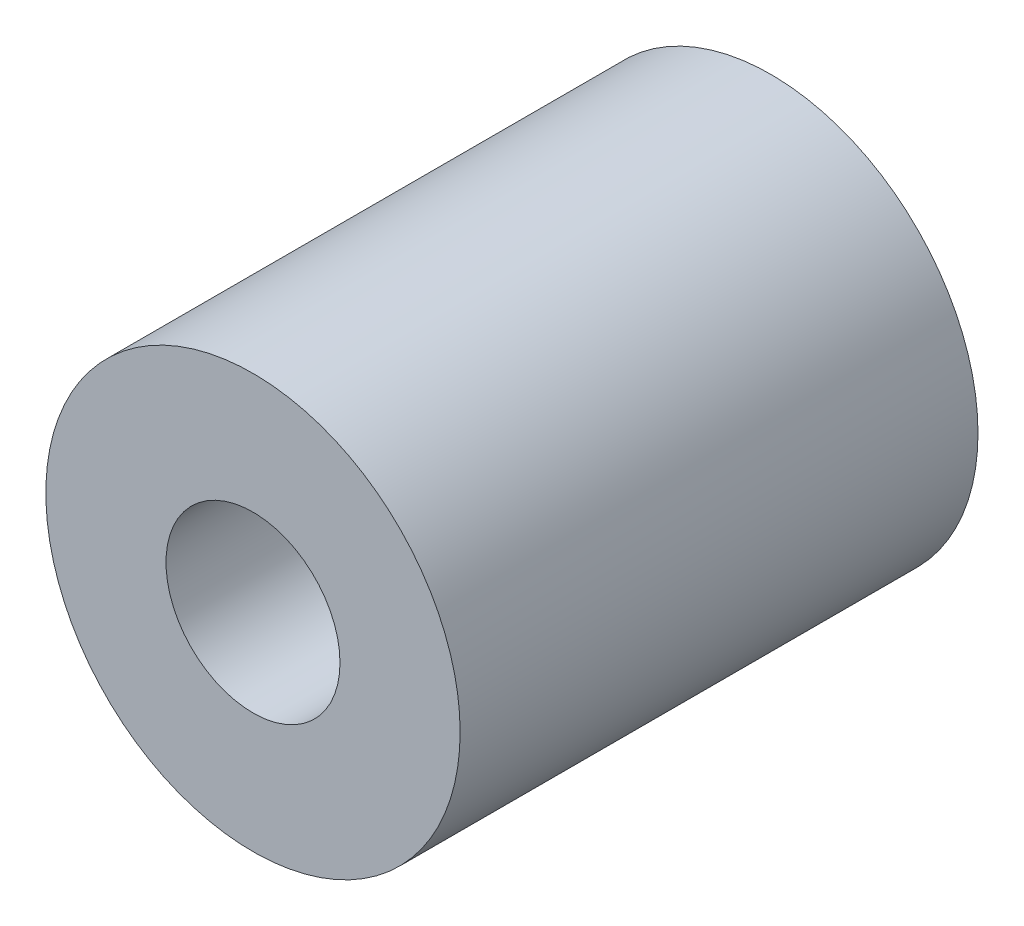
ISO-10303-21;
HEADER;
FILE_DESCRIPTION(('STEP AP214'),'2;1');
FILE_NAME('part.step','',(''),(''),'','','');
FILE_SCHEMA(('AUTOMOTIVE_DESIGN { 1 0 10303 214 1 1 1 1 }'));
ENDSEC;
DATA;
#1=APPLICATION_CONTEXT('core data for automotive mechanical design processes');
#2=APPLICATION_PROTOCOL_DEFINITION('international standard','automotive_design',2000,#1);
#3=PRODUCT_CONTEXT('',#1,'mechanical');
#4=PRODUCT('Part','Part','',(#3));
#5=PRODUCT_RELATED_PRODUCT_CATEGORY('part','',(#4));
#6=PRODUCT_DEFINITION_FORMATION('','',#4);
#7=PRODUCT_DEFINITION_CONTEXT('part definition',#1,'design');
#8=PRODUCT_DEFINITION('design','',#6,#7);
#9=PRODUCT_DEFINITION_SHAPE('','',#8);
#10=(LENGTH_UNIT() NAMED_UNIT(*) SI_UNIT(.MILLI.,.METRE.));
#11=(NAMED_UNIT(*) PLANE_ANGLE_UNIT() SI_UNIT($,.RADIAN.));
#12=(NAMED_UNIT(*) SI_UNIT($,.STERADIAN.) SOLID_ANGLE_UNIT());
#13=UNCERTAINTY_MEASURE_WITH_UNIT(LENGTH_MEASURE(1.E-05),#10,'distance_accuracy_value','');
#14=(GEOMETRIC_REPRESENTATION_CONTEXT(3) GLOBAL_UNCERTAINTY_ASSIGNED_CONTEXT((#13)) GLOBAL_UNIT_ASSIGNED_CONTEXT((#10,
#11,#12)) REPRESENTATION_CONTEXT('',''));
#15=CARTESIAN_POINT('',(0.,0.,0.));
#16=DIRECTION('',(0.,0.,1.));
#17=DIRECTION('',(1.,0.,0.));
#18=AXIS2_PLACEMENT_3D('',#15,#16,#17);
#19=CARTESIAN_POINT('',(0.,0.,25.));
#20=DIRECTION('',(0.,0.,-1.));
#21=DIRECTION('',(-1.,0.,0.));
#22=AXIS2_PLACEMENT_3D('',#19,#20,#21);
#23=CYLINDRICAL_SURFACE('',#22,10.);
#24=CARTESIAN_POINT('',(0.,0.,25.));
#25=DIRECTION('',(0.,0.,1.));
#26=DIRECTION('',(1.,0.,0.));
#27=AXIS2_PLACEMENT_3D('',#24,#25,#26);
#28=CIRCLE('',#27,10.);
#29=CARTESIAN_POINT('',(10.,0.,25.));
#30=VERTEX_POINT('',#29);
#31=EDGE_CURVE('E10',#30,#30,#28,.T.);
#32=ORIENTED_EDGE('',*,*,#31,.F.);
#33=EDGE_LOOP('',(#32));
#34=FACE_BOUND('',#33,.T.);
#35=CARTESIAN_POINT('',(0.,0.,0.));
#36=DIRECTION('',(0.,0.,1.));
#37=DIRECTION('',(1.,0.,0.));
#38=AXIS2_PLACEMENT_3D('',#35,#36,#37);
#39=CIRCLE('',#38,10.);
#40=CARTESIAN_POINT('',(10.,0.,0.));
#41=VERTEX_POINT('',#40);
#42=EDGE_CURVE('E34',#41,#41,#39,.T.);
#43=ORIENTED_EDGE('',*,*,#42,.T.);
#44=EDGE_LOOP('',(#43));
#45=FACE_BOUND('',#44,.T.);
#46=ADVANCED_FACE('F31',(#34,#45),#23,.T.);
#47=CARTESIAN_POINT('',(0.,0.,25.));
#48=DIRECTION('',(0.,0.,1.));
#49=DIRECTION('',(1.,0.,0.));
#50=AXIS2_PLACEMENT_3D('',#47,#48,#49);
#51=PLANE('',#50);
#52=CARTESIAN_POINT('',(0.,0.,25.));
#53=DIRECTION('',(0.,0.,1.));
#54=DIRECTION('',(1.,0.,0.));
#55=AXIS2_PLACEMENT_3D('',#52,#53,#54);
#56=CIRCLE('',#55,4.19999999999999);
#57=CARTESIAN_POINT('',(4.19999999999999,0.,25.));
#58=VERTEX_POINT('',#57);
#59=EDGE_CURVE('E45',#58,#58,#56,.T.);
#60=ORIENTED_EDGE('',*,*,#59,.F.);
#61=EDGE_LOOP('',(#60));
#62=FACE_BOUND('',#61,.T.);
#63=ORIENTED_EDGE('',*,*,#31,.T.);
#64=EDGE_LOOP('',(#63));
#65=FACE_BOUND('',#64,.T.);
#66=ADVANCED_FACE('F51',(#62,#65),#51,.T.);
#67=CARTESIAN_POINT('',(0.,0.,0.));
#68=DIRECTION('',(0.,0.,1.));
#69=DIRECTION('',(1.,0.,0.));
#70=AXIS2_PLACEMENT_3D('',#67,#68,#69);
#71=PLANE('',#70);
#72=CARTESIAN_POINT('',(0.,0.,0.));
#73=DIRECTION('',(0.,0.,1.));
#74=DIRECTION('',(1.,0.,0.));
#75=AXIS2_PLACEMENT_3D('',#72,#73,#74);
#76=CIRCLE('',#75,4.2);
#77=CARTESIAN_POINT('',(4.2,0.,0.));
#78=VERTEX_POINT('',#77);
#79=EDGE_CURVE('E41',#78,#78,#76,.T.);
#80=ORIENTED_EDGE('',*,*,#79,.T.);
#81=EDGE_LOOP('',(#80));
#82=FACE_BOUND('',#81,.T.);
#83=ORIENTED_EDGE('',*,*,#42,.F.);
#84=EDGE_LOOP('',(#83));
#85=FACE_BOUND('',#84,.T.);
#86=ADVANCED_FACE('F53',(#82,#85),#71,.F.);
#87=CARTESIAN_POINT('',(0.,0.,25.));
#88=DIRECTION('',(0.,0.,1.));
#89=DIRECTION('',(1.,0.,0.));
#90=AXIS2_PLACEMENT_3D('',#87,#88,#89);
#91=CYLINDRICAL_SURFACE('',#90,4.19999999999999);
#92=ORIENTED_EDGE('',*,*,#79,.F.);
#93=EDGE_LOOP('',(#92));
#94=FACE_BOUND('',#93,.T.);
#95=ORIENTED_EDGE('',*,*,#59,.T.);
#96=EDGE_LOOP('',(#95));
#97=FACE_BOUND('',#96,.T.);
#98=ADVANCED_FACE('F49',(#94,#97),#91,.F.);
#99=CLOSED_SHELL('',(#46,#66,#86,#98));
#100=MANIFOLD_SOLID_BREP('B2',#99);
#101=ADVANCED_BREP_SHAPE_REPRESENTATION('',(#18,#100),#14);
#102=SHAPE_DEFINITION_REPRESENTATION(#9,#101);
ENDSEC;
END-ISO-10303-21;
